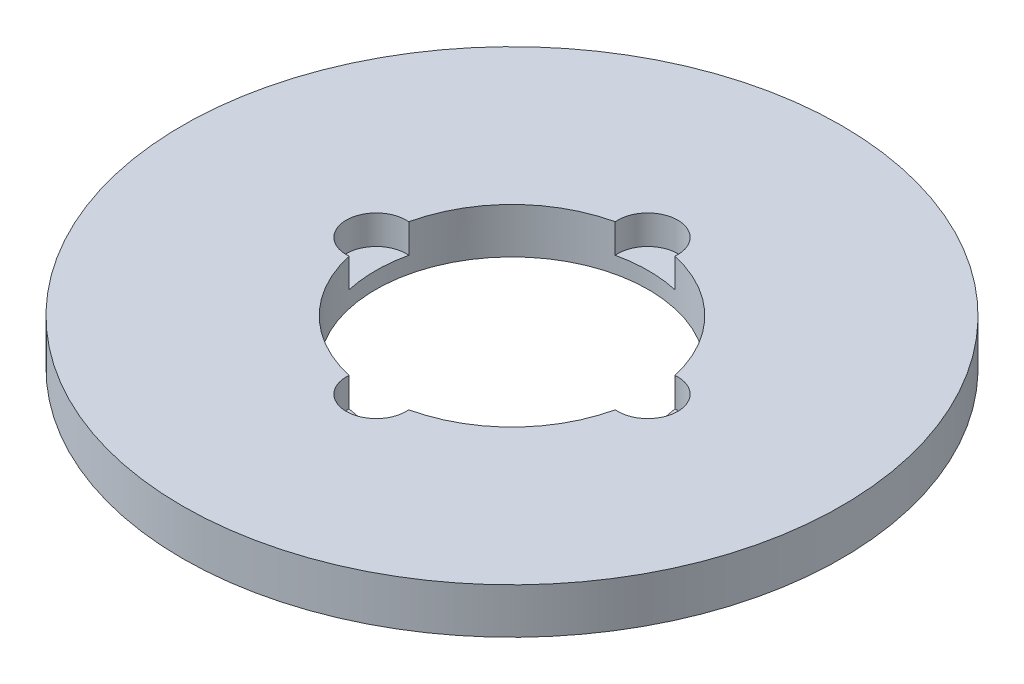
ISO-10303-21;
HEADER;
FILE_DESCRIPTION(('STEP AP214'),'2;1');
FILE_NAME('part.step','',(''),(''),'','','');
FILE_SCHEMA(('AUTOMOTIVE_DESIGN { 1 0 10303 214 1 1 1 1 }'));
ENDSEC;
DATA;
#1=APPLICATION_CONTEXT('core data for automotive mechanical design processes');
#2=APPLICATION_PROTOCOL_DEFINITION('international standard','automotive_design',2000,#1);
#3=PRODUCT_CONTEXT('',#1,'mechanical');
#4=PRODUCT('Part','Part','',(#3));
#5=PRODUCT_RELATED_PRODUCT_CATEGORY('part','',(#4));
#6=PRODUCT_DEFINITION_FORMATION('','',#4);
#7=PRODUCT_DEFINITION_CONTEXT('part definition',#1,'design');
#8=PRODUCT_DEFINITION('design','',#6,#7);
#9=PRODUCT_DEFINITION_SHAPE('','',#8);
#10=(LENGTH_UNIT() NAMED_UNIT(*) SI_UNIT(.MILLI.,.METRE.));
#11=(NAMED_UNIT(*) PLANE_ANGLE_UNIT() SI_UNIT($,.RADIAN.));
#12=(NAMED_UNIT(*) SI_UNIT($,.STERADIAN.) SOLID_ANGLE_UNIT());
#13=UNCERTAINTY_MEASURE_WITH_UNIT(LENGTH_MEASURE(1.E-05),#10,'distance_accuracy_value','');
#14=(GEOMETRIC_REPRESENTATION_CONTEXT(3) GLOBAL_UNCERTAINTY_ASSIGNED_CONTEXT((#13)) GLOBAL_UNIT_ASSIGNED_CONTEXT((#10,
#11,#12)) REPRESENTATION_CONTEXT('',''));
#15=CARTESIAN_POINT('',(0.,0.,0.));
#16=DIRECTION('',(0.,0.,1.));
#17=DIRECTION('',(1.,0.,0.));
#18=AXIS2_PLACEMENT_3D('',#15,#16,#17);
#19=CARTESIAN_POINT('',(0.,10.,0.));
#20=DIRECTION('',(0.,-1.,0.));
#21=DIRECTION('',(0.,0.,-1.));
#22=AXIS2_PLACEMENT_3D('',#19,#20,#21);
#23=CYLINDRICAL_SURFACE('',#22,72.5);
#24=CARTESIAN_POINT('',(0.,10.,0.));
#25=DIRECTION('',(0.,1.,0.));
#26=DIRECTION('',(0.,0.,1.));
#27=AXIS2_PLACEMENT_3D('',#24,#25,#26);
#28=CIRCLE('',#27,72.5);
#29=CARTESIAN_POINT('',(0.,10.,72.5));
#30=VERTEX_POINT('',#29);
#31=EDGE_CURVE('E145',#30,#30,#28,.T.);
#32=ORIENTED_EDGE('',*,*,#31,.F.);
#33=EDGE_LOOP('',(#32));
#34=FACE_BOUND('',#33,.T.);
#35=CARTESIAN_POINT('',(0.,0.,0.));
#36=DIRECTION('',(0.,1.,0.));
#37=DIRECTION('',(0.,0.,1.));
#38=AXIS2_PLACEMENT_3D('',#35,#36,#37);
#39=CIRCLE('',#38,72.5);
#40=CARTESIAN_POINT('',(0.,0.,72.5));
#41=VERTEX_POINT('',#40);
#42=EDGE_CURVE('E143',#41,#41,#39,.T.);
#43=ORIENTED_EDGE('',*,*,#42,.T.);
#44=EDGE_LOOP('',(#43));
#45=FACE_BOUND('',#44,.T.);
#46=ADVANCED_FACE('F39',(#34,#45),#23,.T.);
#47=CARTESIAN_POINT('',(0.,10.,0.));
#48=DIRECTION('',(0.,1.,0.));
#49=DIRECTION('',(0.,0.,1.));
#50=AXIS2_PLACEMENT_3D('',#47,#48,#49);
#51=PLANE('',#50);
#52=CARTESIAN_POINT('',(1.0429897618332E-13,10.,29.8724140447155));
#53=DIRECTION('',(0.,1.,0.));
#54=DIRECTION('',(1.,0.,0.));
#55=AXIS2_PLACEMENT_3D('',#52,#53,#54);
#56=CIRCLE('',#55,6.58749820894437);
#57=CARTESIAN_POINT('',(-6.56025540361579,10.,29.2739312194199));
#58=VERTEX_POINT('',#57);
#59=CARTESIAN_POINT('',(6.560255403616,10.,29.2739312194199));
#60=VERTEX_POINT('',#59);
#61=EDGE_CURVE('E152',#58,#60,#56,.T.);
#62=ORIENTED_EDGE('',*,*,#61,.F.);
#63=CARTESIAN_POINT('',(0.,10.,0.));
#64=DIRECTION('',(0.,1.,0.));
#65=DIRECTION('',(0.,0.,1.));
#66=AXIS2_PLACEMENT_3D('',#63,#64,#65);
#67=CIRCLE('',#66,30.);
#68=CARTESIAN_POINT('',(-29.2739312194199,10.,6.5602554036159));
#69=VERTEX_POINT('',#68);
#70=EDGE_CURVE('E133',#69,#58,#67,.T.);
#71=ORIENTED_EDGE('',*,*,#70,.F.);
#72=CARTESIAN_POINT('',(-29.8724140447155,10.,0.));
#73=DIRECTION('',(0.,1.,0.));
#74=DIRECTION('',(0.,0.,1.));
#75=AXIS2_PLACEMENT_3D('',#72,#73,#74);
#76=CIRCLE('',#75,6.58749820894437);
#77=CARTESIAN_POINT('',(-29.2739312194199,10.,-6.5602554036159));
#78=VERTEX_POINT('',#77);
#79=EDGE_CURVE('E128',#78,#69,#76,.T.);
#80=ORIENTED_EDGE('',*,*,#79,.F.);
#81=CARTESIAN_POINT('',(-6.5602554036162,10.,-29.2739312194199));
#82=VERTEX_POINT('',#81);
#83=EDGE_CURVE('E121',#82,#78,#67,.T.);
#84=ORIENTED_EDGE('',*,*,#83,.F.);
#85=CARTESIAN_POINT('',(-3.12896928549959E-13,10.,-29.8724140447155));
#86=DIRECTION('',(0.,1.,0.));
#87=DIRECTION('',(-1.,0.,0.));
#88=AXIS2_PLACEMENT_3D('',#85,#86,#87);
#89=CIRCLE('',#88,6.58749820894437);
#90=CARTESIAN_POINT('',(6.56025540361559,10.,-29.27393121942));
#91=VERTEX_POINT('',#90);
#92=EDGE_CURVE('E105',#91,#82,#89,.T.);
#93=ORIENTED_EDGE('',*,*,#92,.F.);
#94=CARTESIAN_POINT('',(29.2739312194199,10.,-6.5602554036159));
#95=VERTEX_POINT('',#94);
#96=EDGE_CURVE('E131',#95,#91,#67,.T.);
#97=ORIENTED_EDGE('',*,*,#96,.F.);
#98=CARTESIAN_POINT('',(29.8724140447155,10.,0.));
#99=DIRECTION('',(0.,1.,0.));
#100=DIRECTION('',(0.,0.,-1.));
#101=AXIS2_PLACEMENT_3D('',#98,#99,#100);
#102=CIRCLE('',#101,6.58749820894437);
#103=CARTESIAN_POINT('',(29.2739312194199,10.,6.5602554036159));
#104=VERTEX_POINT('',#103);
#105=EDGE_CURVE('E154',#104,#95,#102,.T.);
#106=ORIENTED_EDGE('',*,*,#105,.F.);
#107=EDGE_CURVE('E134',#60,#104,#67,.T.);
#108=ORIENTED_EDGE('',*,*,#107,.F.);
#109=EDGE_LOOP('',(#62,#71,#80,#84,#93,#97,#106,#108));
#110=FACE_BOUND('',#109,.T.);
#111=ORIENTED_EDGE('',*,*,#31,.T.);
#112=EDGE_LOOP('',(#111));
#113=FACE_BOUND('',#112,.T.);
#114=ADVANCED_FACE('F130',(#110,#113),#51,.T.);
#115=CARTESIAN_POINT('',(0.,0.,0.));
#116=DIRECTION('',(0.,1.,0.));
#117=DIRECTION('',(0.,0.,1.));
#118=AXIS2_PLACEMENT_3D('',#115,#116,#117);
#119=PLANE('',#118);
#120=CARTESIAN_POINT('',(0.,0.,0.));
#121=DIRECTION('',(0.,1.,0.));
#122=DIRECTION('',(0.,0.,1.));
#123=AXIS2_PLACEMENT_3D('',#120,#121,#122);
#124=CIRCLE('',#123,30.);
#125=CARTESIAN_POINT('',(0.,0.,30.));
#126=VERTEX_POINT('',#125);
#127=EDGE_CURVE('E135',#126,#126,#124,.T.);
#128=ORIENTED_EDGE('',*,*,#127,.T.);
#129=EDGE_LOOP('',(#128));
#130=FACE_BOUND('',#129,.T.);
#131=ORIENTED_EDGE('',*,*,#42,.F.);
#132=EDGE_LOOP('',(#131));
#133=FACE_BOUND('',#132,.T.);
#134=ADVANCED_FACE('F195',(#130,#133),#119,.F.);
#135=CARTESIAN_POINT('',(0.,10.,0.));
#136=DIRECTION('',(0.,-1.,0.));
#137=DIRECTION('',(0.,0.,-1.));
#138=AXIS2_PLACEMENT_3D('',#135,#136,#137);
#139=CYLINDRICAL_SURFACE('',#138,30.);
#140=DIRECTION('',(0.,1.,0.));
#141=VECTOR('',#140,1.);
#142=CARTESIAN_POINT('',(-6.56025540361579,6.80278401237821,29.2739312194199));
#143=LINE('',#142,#141);
#144=CARTESIAN_POINT('',(-6.56025540361579,3.60556802475641,29.2739312194199));
#145=VERTEX_POINT('',#144);
#146=EDGE_CURVE('E11',#145,#58,#143,.T.);
#147=ORIENTED_EDGE('',*,*,#146,.F.);
#148=CARTESIAN_POINT('',(0.,3.60556802475641,0.));
#149=DIRECTION('',(0.,1.,0.));
#150=DIRECTION('',(0.,0.,1.));
#151=AXIS2_PLACEMENT_3D('',#148,#149,#150);
#152=CIRCLE('',#151,30.);
#153=CARTESIAN_POINT('',(6.560255403616,3.60556802475641,29.2739312194199));
#154=VERTEX_POINT('',#153);
#155=EDGE_CURVE('E169',#145,#154,#152,.T.);
#156=ORIENTED_EDGE('',*,*,#155,.T.);
#157=DIRECTION('',(0.,1.,0.));
#158=VECTOR('',#157,1.);
#159=CARTESIAN_POINT('',(6.560255403616,6.80278401237821,29.2739312194199));
#160=LINE('',#159,#158);
#161=EDGE_CURVE('E46',#60,#154,#160,.F.);
#162=ORIENTED_EDGE('',*,*,#161,.F.);
#163=ORIENTED_EDGE('',*,*,#107,.T.);
#164=DIRECTION('',(0.,1.,0.));
#165=VECTOR('',#164,1.);
#166=CARTESIAN_POINT('',(29.2739312194199,6.80278401237821,6.5602554036159));
#167=LINE('',#166,#165);
#168=CARTESIAN_POINT('',(29.2739312194199,3.60556802475641,6.5602554036159));
#169=VERTEX_POINT('',#168);
#170=EDGE_CURVE('E151',#169,#104,#167,.T.);
#171=ORIENTED_EDGE('',*,*,#170,.F.);
#172=CARTESIAN_POINT('',(0.,3.60556802475641,0.));
#173=DIRECTION('',(0.,1.,0.));
#174=DIRECTION('',(0.,0.,1.));
#175=AXIS2_PLACEMENT_3D('',#172,#173,#174);
#176=CIRCLE('',#175,30.);
#177=CARTESIAN_POINT('',(29.2739312194199,3.60556802475641,-6.5602554036159));
#178=VERTEX_POINT('',#177);
#179=EDGE_CURVE('E173',#169,#178,#176,.T.);
#180=ORIENTED_EDGE('',*,*,#179,.T.);
#181=DIRECTION('',(0.,1.,0.));
#182=VECTOR('',#181,1.);
#183=CARTESIAN_POINT('',(29.2739312194199,6.80278401237821,-6.5602554036159));
#184=LINE('',#183,#182);
#185=EDGE_CURVE('E168',#95,#178,#184,.F.);
#186=ORIENTED_EDGE('',*,*,#185,.F.);
#187=ORIENTED_EDGE('',*,*,#96,.T.);
#188=DIRECTION('',(0.,1.,0.));
#189=VECTOR('',#188,1.);
#190=CARTESIAN_POINT('',(6.56025540361559,6.80278401237821,-29.27393121942));
#191=LINE('',#190,#189);
#192=CARTESIAN_POINT('',(6.56025540361559,3.60556802475641,-29.27393121942));
#193=VERTEX_POINT('',#192);
#194=EDGE_CURVE('E108',#193,#91,#191,.T.);
#195=ORIENTED_EDGE('',*,*,#194,.F.);
#196=CARTESIAN_POINT('',(0.,3.60556802475641,0.));
#197=DIRECTION('',(0.,1.,0.));
#198=DIRECTION('',(0.,0.,1.));
#199=AXIS2_PLACEMENT_3D('',#196,#197,#198);
#200=CIRCLE('',#199,30.);
#201=CARTESIAN_POINT('',(-6.5602554036162,3.60556802475641,-29.2739312194199));
#202=VERTEX_POINT('',#201);
#203=EDGE_CURVE('E122',#193,#202,#200,.T.);
#204=ORIENTED_EDGE('',*,*,#203,.T.);
#205=DIRECTION('',(0.,1.,0.));
#206=VECTOR('',#205,1.);
#207=CARTESIAN_POINT('',(-6.5602554036162,6.80278401237821,-29.2739312194199));
#208=LINE('',#207,#206);
#209=EDGE_CURVE('E106',#82,#202,#208,.F.);
#210=ORIENTED_EDGE('',*,*,#209,.F.);
#211=ORIENTED_EDGE('',*,*,#83,.T.);
#212=DIRECTION('',(0.,1.,0.));
#213=VECTOR('',#212,1.);
#214=CARTESIAN_POINT('',(-29.2739312194199,6.80278401237821,-6.5602554036159));
#215=LINE('',#214,#213);
#216=CARTESIAN_POINT('',(-29.2739312194199,3.60556802475641,-6.5602554036159));
#217=VERTEX_POINT('',#216);
#218=EDGE_CURVE('E177',#217,#78,#215,.T.);
#219=ORIENTED_EDGE('',*,*,#218,.F.);
#220=CARTESIAN_POINT('',(0.,3.60556802475641,0.));
#221=DIRECTION('',(0.,1.,0.));
#222=DIRECTION('',(0.,0.,1.));
#223=AXIS2_PLACEMENT_3D('',#220,#221,#222);
#224=CIRCLE('',#223,30.);
#225=CARTESIAN_POINT('',(-29.2739312194199,3.60556802475641,6.5602554036159));
#226=VERTEX_POINT('',#225);
#227=EDGE_CURVE('E185',#217,#226,#224,.T.);
#228=ORIENTED_EDGE('',*,*,#227,.T.);
#229=DIRECTION('',(0.,1.,0.));
#230=VECTOR('',#229,1.);
#231=CARTESIAN_POINT('',(-29.2739312194199,6.80278401237821,6.5602554036159));
#232=LINE('',#231,#230);
#233=EDGE_CURVE('E179',#69,#226,#232,.F.);
#234=ORIENTED_EDGE('',*,*,#233,.F.);
#235=ORIENTED_EDGE('',*,*,#70,.T.);
#236=EDGE_LOOP('',(#147,#156,#162,#163,#171,#180,#186,#187,#195,#204,#210,#211,#219,#228,#234,#235));
#237=FACE_BOUND('',#236,.T.);
#238=ORIENTED_EDGE('',*,*,#127,.F.);
#239=EDGE_LOOP('',(#238));
#240=FACE_BOUND('',#239,.T.);
#241=ADVANCED_FACE('F117',(#237,#240),#139,.F.);
#242=CARTESIAN_POINT('',(-29.8724140447155,3.60556802475641,0.));
#243=DIRECTION('',(0.,1.,0.));
#244=DIRECTION('',(0.,0.,1.));
#245=AXIS2_PLACEMENT_3D('',#242,#243,#244);
#246=CYLINDRICAL_SURFACE('',#245,6.58749820894437);
#247=ORIENTED_EDGE('',*,*,#218,.T.);
#248=ORIENTED_EDGE('',*,*,#79,.T.);
#249=ORIENTED_EDGE('',*,*,#233,.T.);
#250=CARTESIAN_POINT('',(-29.8724140447155,3.60556802475641,0.));
#251=DIRECTION('',(0.,1.,0.));
#252=DIRECTION('',(0.,0.,1.));
#253=AXIS2_PLACEMENT_3D('',#250,#251,#252);
#254=CIRCLE('',#253,6.58749820894437);
#255=EDGE_CURVE('E140',#217,#226,#254,.T.);
#256=ORIENTED_EDGE('',*,*,#255,.F.);
#257=EDGE_LOOP('',(#247,#248,#249,#256));
#258=FACE_BOUND('',#257,.T.);
#259=ADVANCED_FACE('F200',(#258),#246,.F.);
#260=CARTESIAN_POINT('',(-29.8724140447155,3.60556802475641,0.));
#261=DIRECTION('',(0.,1.,0.));
#262=DIRECTION('',(0.,0.,1.));
#263=AXIS2_PLACEMENT_3D('',#260,#261,#262);
#264=PLANE('',#263);
#265=ORIENTED_EDGE('',*,*,#255,.T.);
#266=ORIENTED_EDGE('',*,*,#227,.F.);
#267=EDGE_LOOP('',(#265,#266));
#268=FACE_BOUND('',#267,.T.);
#269=ADVANCED_FACE('F202',(#268),#264,.T.);
#270=CARTESIAN_POINT('',(-3.12896928549959E-13,3.60556802475641,-29.8724140447155));
#271=DIRECTION('',(0.,1.,0.));
#272=DIRECTION('',(0.,0.,1.));
#273=AXIS2_PLACEMENT_3D('',#270,#271,#272);
#274=CYLINDRICAL_SURFACE('',#273,6.58749820894437);
#275=ORIENTED_EDGE('',*,*,#194,.T.);
#276=ORIENTED_EDGE('',*,*,#92,.T.);
#277=ORIENTED_EDGE('',*,*,#209,.T.);
#278=CARTESIAN_POINT('',(-3.12896928549959E-13,3.60556802475641,-29.8724140447155));
#279=DIRECTION('',(0.,1.,0.));
#280=DIRECTION('',(-1.,0.,0.));
#281=AXIS2_PLACEMENT_3D('',#278,#279,#280);
#282=CIRCLE('',#281,6.58749820894437);
#283=EDGE_CURVE('E111',#193,#202,#282,.T.);
#284=ORIENTED_EDGE('',*,*,#283,.F.);
#285=EDGE_LOOP('',(#275,#276,#277,#284));
#286=FACE_BOUND('',#285,.T.);
#287=ADVANCED_FACE('F102',(#286),#274,.F.);
#288=CARTESIAN_POINT('',(-3.12896928549959E-13,3.60556802475641,-29.8724140447155));
#289=DIRECTION('',(0.,1.,0.));
#290=DIRECTION('',(-1.,0.,0.));
#291=AXIS2_PLACEMENT_3D('',#288,#289,#290);
#292=PLANE('',#291);
#293=ORIENTED_EDGE('',*,*,#283,.T.);
#294=ORIENTED_EDGE('',*,*,#203,.F.);
#295=EDGE_LOOP('',(#293,#294));
#296=FACE_BOUND('',#295,.T.);
#297=ADVANCED_FACE('F211',(#296),#292,.T.);
#298=CARTESIAN_POINT('',(29.8724140447155,3.60556802475641,0.));
#299=DIRECTION('',(0.,1.,0.));
#300=DIRECTION('',(0.,0.,1.));
#301=AXIS2_PLACEMENT_3D('',#298,#299,#300);
#302=CYLINDRICAL_SURFACE('',#301,6.58749820894437);
#303=ORIENTED_EDGE('',*,*,#170,.T.);
#304=ORIENTED_EDGE('',*,*,#105,.T.);
#305=ORIENTED_EDGE('',*,*,#185,.T.);
#306=CARTESIAN_POINT('',(29.8724140447155,3.60556802475641,0.));
#307=DIRECTION('',(0.,1.,0.));
#308=DIRECTION('',(0.,0.,-1.));
#309=AXIS2_PLACEMENT_3D('',#306,#307,#308);
#310=CIRCLE('',#309,6.58749820894437);
#311=EDGE_CURVE('E56',#169,#178,#310,.T.);
#312=ORIENTED_EDGE('',*,*,#311,.F.);
#313=EDGE_LOOP('',(#303,#304,#305,#312));
#314=FACE_BOUND('',#313,.T.);
#315=ADVANCED_FACE('F212',(#314),#302,.F.);
#316=CARTESIAN_POINT('',(29.8724140447155,3.60556802475641,0.));
#317=DIRECTION('',(0.,1.,0.));
#318=DIRECTION('',(0.,0.,-1.));
#319=AXIS2_PLACEMENT_3D('',#316,#317,#318);
#320=PLANE('',#319);
#321=ORIENTED_EDGE('',*,*,#311,.T.);
#322=ORIENTED_EDGE('',*,*,#179,.F.);
#323=EDGE_LOOP('',(#321,#322));
#324=FACE_BOUND('',#323,.T.);
#325=ADVANCED_FACE('F217',(#324),#320,.T.);
#326=CARTESIAN_POINT('',(1.0429897618332E-13,3.60556802475641,29.8724140447155));
#327=DIRECTION('',(0.,1.,0.));
#328=DIRECTION('',(0.,0.,1.));
#329=AXIS2_PLACEMENT_3D('',#326,#327,#328);
#330=CYLINDRICAL_SURFACE('',#329,6.58749820894437);
#331=ORIENTED_EDGE('',*,*,#146,.T.);
#332=ORIENTED_EDGE('',*,*,#61,.T.);
#333=ORIENTED_EDGE('',*,*,#161,.T.);
#334=CARTESIAN_POINT('',(1.0429897618332E-13,3.60556802475641,29.8724140447155));
#335=DIRECTION('',(0.,1.,0.));
#336=DIRECTION('',(1.,0.,0.));
#337=AXIS2_PLACEMENT_3D('',#334,#335,#336);
#338=CIRCLE('',#337,6.58749820894437);
#339=EDGE_CURVE('E55',#145,#154,#338,.T.);
#340=ORIENTED_EDGE('',*,*,#339,.F.);
#341=EDGE_LOOP('',(#331,#332,#333,#340));
#342=FACE_BOUND('',#341,.T.);
#343=ADVANCED_FACE('F170',(#342),#330,.F.);
#344=CARTESIAN_POINT('',(1.0429897618332E-13,3.60556802475641,29.8724140447155));
#345=DIRECTION('',(0.,1.,0.));
#346=DIRECTION('',(1.,0.,0.));
#347=AXIS2_PLACEMENT_3D('',#344,#345,#346);
#348=PLANE('',#347);
#349=ORIENTED_EDGE('',*,*,#339,.T.);
#350=ORIENTED_EDGE('',*,*,#155,.F.);
#351=EDGE_LOOP('',(#349,#350));
#352=FACE_BOUND('',#351,.T.);
#353=ADVANCED_FACE('F224',(#352),#348,.T.);
#354=CLOSED_SHELL('',(#46,#114,#134,#241,#259,#269,#287,#297,#315,#325,#343,#353));
#355=MANIFOLD_SOLID_BREP('B2',#354);
#356=ADVANCED_BREP_SHAPE_REPRESENTATION('',(#18,#355),#14);
#357=SHAPE_DEFINITION_REPRESENTATION(#9,#356);
ENDSEC;
END-ISO-10303-21;
